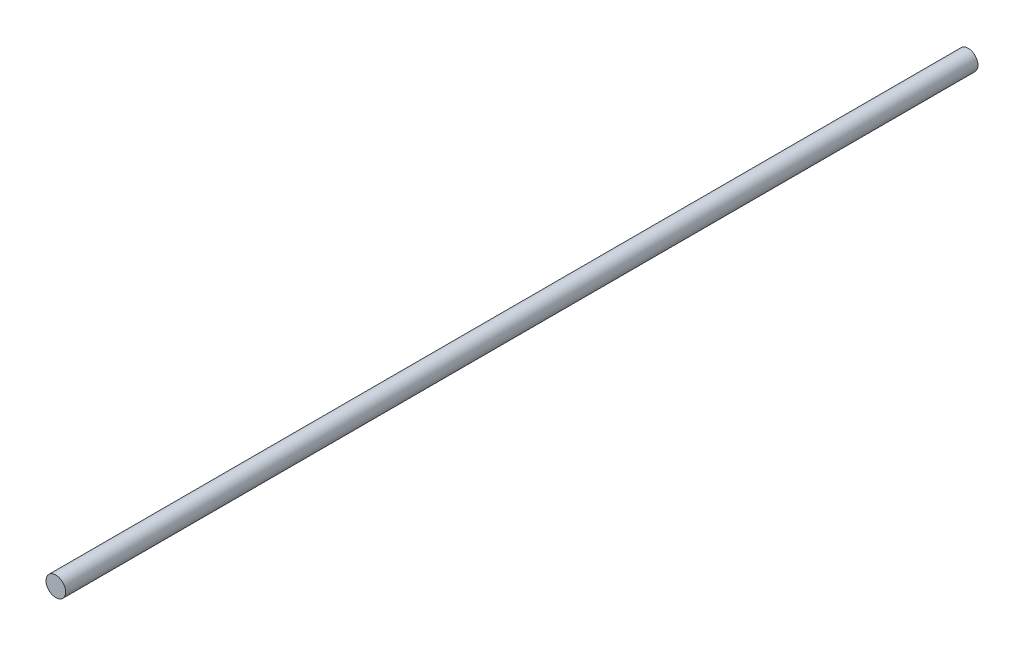
ISO-10303-21;
HEADER;
FILE_DESCRIPTION(('STEP AP214'),'2;1');
FILE_NAME('part.step','',(''),(''),'','','');
FILE_SCHEMA(('AUTOMOTIVE_DESIGN { 1 0 10303 214 1 1 1 1 }'));
ENDSEC;
DATA;
#1=APPLICATION_CONTEXT('core data for automotive mechanical design processes');
#2=APPLICATION_PROTOCOL_DEFINITION('international standard','automotive_design',2000,#1);
#3=PRODUCT_CONTEXT('',#1,'mechanical');
#4=PRODUCT('Part','Part','',(#3));
#5=PRODUCT_RELATED_PRODUCT_CATEGORY('part','',(#4));
#6=PRODUCT_DEFINITION_FORMATION('','',#4);
#7=PRODUCT_DEFINITION_CONTEXT('part definition',#1,'design');
#8=PRODUCT_DEFINITION('design','',#6,#7);
#9=PRODUCT_DEFINITION_SHAPE('','',#8);
#10=(LENGTH_UNIT() NAMED_UNIT(*) SI_UNIT(.MILLI.,.METRE.));
#11=(NAMED_UNIT(*) PLANE_ANGLE_UNIT() SI_UNIT($,.RADIAN.));
#12=(NAMED_UNIT(*) SI_UNIT($,.STERADIAN.) SOLID_ANGLE_UNIT());
#13=UNCERTAINTY_MEASURE_WITH_UNIT(LENGTH_MEASURE(1.E-05),#10,'distance_accuracy_value','');
#14=(GEOMETRIC_REPRESENTATION_CONTEXT(3) GLOBAL_UNCERTAINTY_ASSIGNED_CONTEXT((#13)) GLOBAL_UNIT_ASSIGNED_CONTEXT((#10,
#11,#12)) REPRESENTATION_CONTEXT('',''));
#15=CARTESIAN_POINT('',(0.,0.,0.));
#16=DIRECTION('',(0.,0.,1.));
#17=DIRECTION('',(1.,0.,0.));
#18=AXIS2_PLACEMENT_3D('',#15,#16,#17);
#19=CARTESIAN_POINT('',(0.,0.,368.3));
#20=DIRECTION('',(0.,0.,-1.));
#21=DIRECTION('',(-1.,0.,0.));
#22=AXIS2_PLACEMENT_3D('',#19,#20,#21);
#23=CYLINDRICAL_SURFACE('',#22,3.96875);
#24=CARTESIAN_POINT('',(0.,0.,368.3));
#25=DIRECTION('',(0.,0.,1.));
#26=DIRECTION('',(1.,0.,0.));
#27=AXIS2_PLACEMENT_3D('',#24,#25,#26);
#28=CIRCLE('',#27,3.96875);
#29=CARTESIAN_POINT('',(3.96875,0.,368.3));
#30=VERTEX_POINT('',#29);
#31=EDGE_CURVE('E10',#30,#30,#28,.T.);
#32=ORIENTED_EDGE('',*,*,#31,.F.);
#33=EDGE_LOOP('',(#32));
#34=FACE_BOUND('',#33,.T.);
#35=CARTESIAN_POINT('',(0.,0.,0.));
#36=DIRECTION('',(0.,0.,1.));
#37=DIRECTION('',(1.,0.,0.));
#38=AXIS2_PLACEMENT_3D('',#35,#36,#37);
#39=CIRCLE('',#38,3.96875);
#40=CARTESIAN_POINT('',(3.96875,0.,0.));
#41=VERTEX_POINT('',#40);
#42=EDGE_CURVE('E33',#41,#41,#39,.T.);
#43=ORIENTED_EDGE('',*,*,#42,.T.);
#44=EDGE_LOOP('',(#43));
#45=FACE_BOUND('',#44,.T.);
#46=ADVANCED_FACE('F30',(#34,#45),#23,.T.);
#47=CARTESIAN_POINT('',(0.,0.,368.3));
#48=DIRECTION('',(0.,0.,1.));
#49=DIRECTION('',(1.,0.,0.));
#50=AXIS2_PLACEMENT_3D('',#47,#48,#49);
#51=PLANE('',#50);
#52=ORIENTED_EDGE('',*,*,#31,.T.);
#53=EDGE_LOOP('',(#52));
#54=FACE_BOUND('',#53,.T.);
#55=ADVANCED_FACE('F45',(#54),#51,.T.);
#56=CARTESIAN_POINT('',(0.,0.,0.));
#57=DIRECTION('',(0.,0.,1.));
#58=DIRECTION('',(1.,0.,0.));
#59=AXIS2_PLACEMENT_3D('',#56,#57,#58);
#60=PLANE('',#59);
#61=ORIENTED_EDGE('',*,*,#42,.F.);
#62=EDGE_LOOP('',(#61));
#63=FACE_BOUND('',#62,.T.);
#64=ADVANCED_FACE('F43',(#63),#60,.F.);
#65=CLOSED_SHELL('',(#46,#55,#64));
#66=MANIFOLD_SOLID_BREP('B2',#65);
#67=ADVANCED_BREP_SHAPE_REPRESENTATION('',(#18,#66),#14);
#68=SHAPE_DEFINITION_REPRESENTATION(#9,#67);
ENDSEC;
END-ISO-10303-21;
